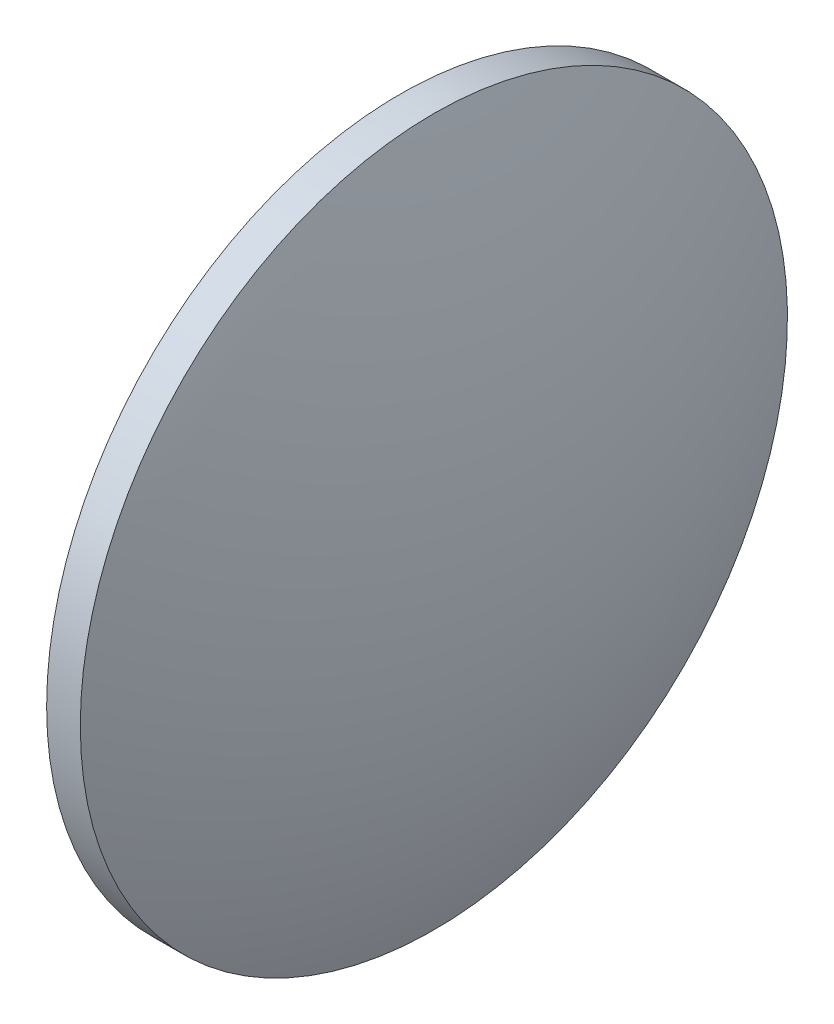
ISO-10303-21;
HEADER;
FILE_DESCRIPTION(('STEP AP214'),'2;1');
FILE_NAME('part.step','',(''),(''),'','','');
FILE_SCHEMA(('AUTOMOTIVE_DESIGN { 1 0 10303 214 1 1 1 1 }'));
ENDSEC;
DATA;
#1=APPLICATION_CONTEXT('core data for automotive mechanical design processes');
#2=APPLICATION_PROTOCOL_DEFINITION('international standard','automotive_design',2000,#1);
#3=PRODUCT_CONTEXT('',#1,'mechanical');
#4=PRODUCT('Part','Part','',(#3));
#5=PRODUCT_RELATED_PRODUCT_CATEGORY('part','',(#4));
#6=PRODUCT_DEFINITION_FORMATION('','',#4);
#7=PRODUCT_DEFINITION_CONTEXT('part definition',#1,'design');
#8=PRODUCT_DEFINITION('design','',#6,#7);
#9=PRODUCT_DEFINITION_SHAPE('','',#8);
#10=(LENGTH_UNIT() NAMED_UNIT(*) SI_UNIT(.MILLI.,.METRE.));
#11=(NAMED_UNIT(*) PLANE_ANGLE_UNIT() SI_UNIT($,.RADIAN.));
#12=(NAMED_UNIT(*) SI_UNIT($,.STERADIAN.) SOLID_ANGLE_UNIT());
#13=UNCERTAINTY_MEASURE_WITH_UNIT(LENGTH_MEASURE(1.E-05),#10,'distance_accuracy_value','');
#14=(GEOMETRIC_REPRESENTATION_CONTEXT(3) GLOBAL_UNCERTAINTY_ASSIGNED_CONTEXT((#13)) GLOBAL_UNIT_ASSIGNED_CONTEXT((#10,
#11,#12)) REPRESENTATION_CONTEXT('',''));
#15=CARTESIAN_POINT('',(0.,0.,0.));
#16=DIRECTION('',(0.,0.,1.));
#17=DIRECTION('',(1.,0.,0.));
#18=AXIS2_PLACEMENT_3D('',#15,#16,#17);
#19=CARTESIAN_POINT('',(153.506089462926,130.518581456956,0.));
#20=DIRECTION('',(-1.,0.,0.));
#21=DIRECTION('',(0.,1.,0.));
#22=AXIS2_PLACEMENT_3D('',#19,#20,#21);
#23=SPHERICAL_SURFACE('',#22,82.6272115384614);
#24=CARTESIAN_POINT('',(229.893301001387,130.518581456956,0.));
#25=DIRECTION('',(-1.,0.,0.));
#26=DIRECTION('',(0.,0.,1.));
#27=AXIS2_PLACEMENT_3D('',#24,#25,#26);
#28=CIRCLE('',#27,31.5);
#29=CARTESIAN_POINT('',(229.893301001387,130.518581456956,31.5));
#30=VERTEX_POINT('',#29);
#31=EDGE_CURVE('E10',#30,#30,#28,.T.);
#32=ORIENTED_EDGE('',*,*,#31,.F.);
#33=EDGE_LOOP('',(#32));
#34=FACE_BOUND('',#33,.T.);
#35=ADVANCED_FACE('F35',(#34),#23,.T.);
#36=CARTESIAN_POINT('',(218.123666737155,130.518581456956,0.));
#37=DIRECTION('',(-1.,0.,0.));
#38=DIRECTION('',(0.,0.,1.));
#39=AXIS2_PLACEMENT_3D('',#36,#37,#38);
#40=CYLINDRICAL_SURFACE('',#39,31.5);
#41=CARTESIAN_POINT('',(226.893301001387,130.518581456956,0.));
#42=DIRECTION('',(-1.,0.,0.));
#43=DIRECTION('',(0.,0.,1.));
#44=AXIS2_PLACEMENT_3D('',#41,#42,#43);
#45=CIRCLE('',#44,31.5);
#46=CARTESIAN_POINT('',(226.893301001387,130.518581456956,31.5));
#47=VERTEX_POINT('',#46);
#48=EDGE_CURVE('E41',#47,#47,#45,.T.);
#49=ORIENTED_EDGE('',*,*,#48,.F.);
#50=EDGE_LOOP('',(#49));
#51=FACE_BOUND('',#50,.T.);
#52=ORIENTED_EDGE('',*,*,#31,.T.);
#53=EDGE_LOOP('',(#52));
#54=FACE_BOUND('',#53,.T.);
#55=ADVANCED_FACE('F49',(#51,#54),#40,.T.);
#56=CARTESIAN_POINT('',(226.893301001387,130.518581456956,0.));
#57=DIRECTION('',(1.,0.,0.));
#58=DIRECTION('',(0.,0.,-1.));
#59=AXIS2_PLACEMENT_3D('',#56,#57,#58);
#60=PLANE('',#59);
#61=ORIENTED_EDGE('',*,*,#48,.T.);
#62=EDGE_LOOP('',(#61));
#63=FACE_BOUND('',#62,.T.);
#64=ADVANCED_FACE('F47',(#63),#60,.F.);
#65=CLOSED_SHELL('',(#35,#55,#64));
#66=MANIFOLD_SOLID_BREP('B2',#65);
#67=ADVANCED_BREP_SHAPE_REPRESENTATION('',(#18,#66),#14);
#68=SHAPE_DEFINITION_REPRESENTATION(#9,#67);
ENDSEC;
END-ISO-10303-21;
